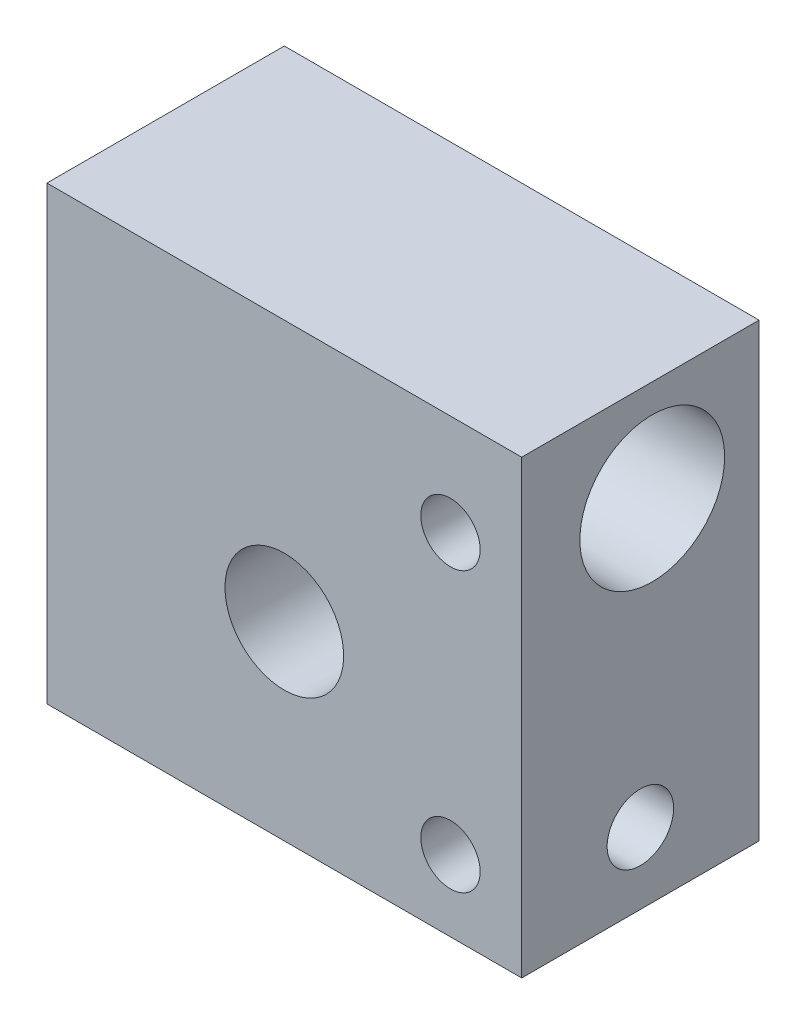
ISO-10303-21;
HEADER;
FILE_DESCRIPTION(('STEP AP214'),'2;1');
FILE_NAME('part.step','',(''),(''),'','','');
FILE_SCHEMA(('AUTOMOTIVE_DESIGN { 1 0 10303 214 1 1 1 1 }'));
ENDSEC;
DATA;
#1=APPLICATION_CONTEXT('core data for automotive mechanical design processes');
#2=APPLICATION_PROTOCOL_DEFINITION('international standard','automotive_design',2000,#1);
#3=PRODUCT_CONTEXT('',#1,'mechanical');
#4=PRODUCT('Part','Part','',(#3));
#5=PRODUCT_RELATED_PRODUCT_CATEGORY('part','',(#4));
#6=PRODUCT_DEFINITION_FORMATION('','',#4);
#7=PRODUCT_DEFINITION_CONTEXT('part definition',#1,'design');
#8=PRODUCT_DEFINITION('design','',#6,#7);
#9=PRODUCT_DEFINITION_SHAPE('','',#8);
#10=(LENGTH_UNIT() NAMED_UNIT(*) SI_UNIT(.MILLI.,.METRE.));
#11=(NAMED_UNIT(*) PLANE_ANGLE_UNIT() SI_UNIT($,.RADIAN.));
#12=(NAMED_UNIT(*) SI_UNIT($,.STERADIAN.) SOLID_ANGLE_UNIT());
#13=UNCERTAINTY_MEASURE_WITH_UNIT(LENGTH_MEASURE(1.E-05),#10,'distance_accuracy_value','');
#14=(GEOMETRIC_REPRESENTATION_CONTEXT(3) GLOBAL_UNCERTAINTY_ASSIGNED_CONTEXT((#13)) GLOBAL_UNIT_ASSIGNED_CONTEXT((#10,
#11,#12)) REPRESENTATION_CONTEXT('',''));
#15=CARTESIAN_POINT('',(0.,0.,0.));
#16=DIRECTION('',(0.,0.,1.));
#17=DIRECTION('',(1.,0.,0.));
#18=AXIS2_PLACEMENT_3D('',#15,#16,#17);
#19=CARTESIAN_POINT('',(10.,-9.5,10.));
#20=DIRECTION('',(-1.,0.,0.));
#21=DIRECTION('',(0.,0.,1.));
#22=AXIS2_PLACEMENT_3D('',#19,#20,#21);
#23=PLANE('',#22);
#24=CARTESIAN_POINT('',(10.,-6.5,5.));
#25=DIRECTION('',(1.,0.,0.));
#26=DIRECTION('',(0.,0.,-1.));
#27=AXIS2_PLACEMENT_3D('',#24,#25,#26);
#28=CIRCLE('',#27,1.39999999999999);
#29=CARTESIAN_POINT('',(10.,-6.5,3.60000000000001));
#30=VERTEX_POINT('',#29);
#31=EDGE_CURVE('E98',#30,#30,#28,.T.);
#32=ORIENTED_EDGE('',*,*,#31,.F.);
#33=EDGE_LOOP('',(#32));
#34=FACE_BOUND('',#33,.T.);
#35=CARTESIAN_POINT('',(10.,5.25,4.5));
#36=DIRECTION('',(1.,0.,0.));
#37=DIRECTION('',(0.,0.,-1.));
#38=AXIS2_PLACEMENT_3D('',#35,#36,#37);
#39=CIRCLE('',#38,3.05);
#40=CARTESIAN_POINT('',(10.,5.25,1.45));
#41=VERTEX_POINT('',#40);
#42=EDGE_CURVE('E97',#41,#41,#39,.T.);
#43=ORIENTED_EDGE('',*,*,#42,.F.);
#44=EDGE_LOOP('',(#43));
#45=FACE_BOUND('',#44,.T.);
#46=DIRECTION('',(0.,1.,0.));
#47=VECTOR('',#46,1.);
#48=CARTESIAN_POINT('',(10.,-9.5,0.));
#49=LINE('',#48,#47);
#50=CARTESIAN_POINT('',(10.,-9.5,0.));
#51=VERTEX_POINT('',#50);
#52=CARTESIAN_POINT('',(10.,9.5,0.));
#53=VERTEX_POINT('',#52);
#54=EDGE_CURVE('E114',#51,#53,#49,.T.);
#55=ORIENTED_EDGE('',*,*,#54,.T.);
#56=DIRECTION('',(0.,0.,-1.));
#57=VECTOR('',#56,1.);
#58=CARTESIAN_POINT('',(10.,9.5,10.));
#59=LINE('',#58,#57);
#60=CARTESIAN_POINT('',(10.,9.5,10.));
#61=VERTEX_POINT('',#60);
#62=EDGE_CURVE('E11',#61,#53,#59,.T.);
#63=ORIENTED_EDGE('',*,*,#62,.F.);
#64=DIRECTION('',(0.,1.,0.));
#65=VECTOR('',#64,1.);
#66=CARTESIAN_POINT('',(10.,-9.5,10.));
#67=LINE('',#66,#65);
#68=CARTESIAN_POINT('',(10.,-9.5,10.));
#69=VERTEX_POINT('',#68);
#70=EDGE_CURVE('E117',#69,#61,#67,.T.);
#71=ORIENTED_EDGE('',*,*,#70,.F.);
#72=DIRECTION('',(0.,0.,-1.));
#73=VECTOR('',#72,1.);
#74=CARTESIAN_POINT('',(10.,-9.5,10.));
#75=LINE('',#74,#73);
#76=EDGE_CURVE('E123',#69,#51,#75,.T.);
#77=ORIENTED_EDGE('',*,*,#76,.T.);
#78=EDGE_LOOP('',(#55,#63,#71,#77));
#79=FACE_BOUND('',#78,.T.);
#80=ADVANCED_FACE('F36',(#34,#45,#79),#23,.F.);
#81=CARTESIAN_POINT('',(-10.,9.5,10.));
#82=DIRECTION('',(0.,-1.,0.));
#83=DIRECTION('',(0.,0.,-1.));
#84=AXIS2_PLACEMENT_3D('',#81,#82,#83);
#85=PLANE('',#84);
#86=DIRECTION('',(-1.,0.,0.));
#87=VECTOR('',#86,1.);
#88=CARTESIAN_POINT('',(-10.,9.5,0.));
#89=LINE('',#88,#87);
#90=CARTESIAN_POINT('',(-10.,9.5,0.));
#91=VERTEX_POINT('',#90);
#92=EDGE_CURVE('E126',#53,#91,#89,.T.);
#93=ORIENTED_EDGE('',*,*,#92,.T.);
#94=DIRECTION('',(0.,0.,-1.));
#95=VECTOR('',#94,1.);
#96=CARTESIAN_POINT('',(-10.,9.5,10.));
#97=LINE('',#96,#95);
#98=CARTESIAN_POINT('',(-10.,9.5,10.));
#99=VERTEX_POINT('',#98);
#100=EDGE_CURVE('E44',#99,#91,#97,.T.);
#101=ORIENTED_EDGE('',*,*,#100,.F.);
#102=DIRECTION('',(-1.,0.,0.));
#103=VECTOR('',#102,1.);
#104=CARTESIAN_POINT('',(-10.,9.5,10.));
#105=LINE('',#104,#103);
#106=EDGE_CURVE('E83',#61,#99,#105,.T.);
#107=ORIENTED_EDGE('',*,*,#106,.F.);
#108=ORIENTED_EDGE('',*,*,#62,.T.);
#109=EDGE_LOOP('',(#93,#101,#107,#108));
#110=FACE_BOUND('',#109,.T.);
#111=ADVANCED_FACE('F150',(#110),#85,.F.);
#112=CARTESIAN_POINT('',(-10.,-9.5,10.));
#113=DIRECTION('',(1.,0.,0.));
#114=DIRECTION('',(0.,0.,-1.));
#115=AXIS2_PLACEMENT_3D('',#112,#113,#114);
#116=PLANE('',#115);
#117=CARTESIAN_POINT('',(-10.,5.25,4.5));
#118=DIRECTION('',(1.,0.,0.));
#119=DIRECTION('',(0.,0.,-1.));
#120=AXIS2_PLACEMENT_3D('',#117,#118,#119);
#121=CIRCLE('',#120,3.05);
#122=CARTESIAN_POINT('',(-10.,5.25,1.45));
#123=VERTEX_POINT('',#122);
#124=EDGE_CURVE('E101',#123,#123,#121,.T.);
#125=ORIENTED_EDGE('',*,*,#124,.T.);
#126=EDGE_LOOP('',(#125));
#127=FACE_BOUND('',#126,.T.);
#128=DIRECTION('',(0.,-1.,0.));
#129=VECTOR('',#128,1.);
#130=CARTESIAN_POINT('',(-10.,-9.5,0.));
#131=LINE('',#130,#129);
#132=CARTESIAN_POINT('',(-10.,-9.5,0.));
#133=VERTEX_POINT('',#132);
#134=EDGE_CURVE('E70',#91,#133,#131,.T.);
#135=ORIENTED_EDGE('',*,*,#134,.T.);
#136=DIRECTION('',(0.,0.,-1.));
#137=VECTOR('',#136,1.);
#138=CARTESIAN_POINT('',(-10.,-9.5,10.));
#139=LINE('',#138,#137);
#140=CARTESIAN_POINT('',(-10.,-9.5,10.));
#141=VERTEX_POINT('',#140);
#142=EDGE_CURVE('E131',#141,#133,#139,.T.);
#143=ORIENTED_EDGE('',*,*,#142,.F.);
#144=DIRECTION('',(0.,-1.,0.));
#145=VECTOR('',#144,1.);
#146=CARTESIAN_POINT('',(-10.,-9.5,10.));
#147=LINE('',#146,#145);
#148=EDGE_CURVE('E120',#99,#141,#147,.T.);
#149=ORIENTED_EDGE('',*,*,#148,.F.);
#150=ORIENTED_EDGE('',*,*,#100,.T.);
#151=EDGE_LOOP('',(#135,#143,#149,#150));
#152=FACE_BOUND('',#151,.T.);
#153=ADVANCED_FACE('F133',(#127,#152),#116,.F.);
#154=CARTESIAN_POINT('',(-10.,-9.5,10.));
#155=DIRECTION('',(0.,1.,0.));
#156=DIRECTION('',(0.,0.,1.));
#157=AXIS2_PLACEMENT_3D('',#154,#155,#156);
#158=PLANE('',#157);
#159=DIRECTION('',(1.,0.,0.));
#160=VECTOR('',#159,1.);
#161=CARTESIAN_POINT('',(-10.,-9.5,0.));
#162=LINE('',#161,#160);
#163=EDGE_CURVE('E76',#133,#51,#162,.T.);
#164=ORIENTED_EDGE('',*,*,#163,.T.);
#165=ORIENTED_EDGE('',*,*,#76,.F.);
#166=DIRECTION('',(1.,0.,0.));
#167=VECTOR('',#166,1.);
#168=CARTESIAN_POINT('',(-10.,-9.5,10.));
#169=LINE('',#168,#167);
#170=EDGE_CURVE('E52',#141,#69,#169,.T.);
#171=ORIENTED_EDGE('',*,*,#170,.F.);
#172=ORIENTED_EDGE('',*,*,#142,.T.);
#173=EDGE_LOOP('',(#164,#165,#171,#172));
#174=FACE_BOUND('',#173,.T.);
#175=ADVANCED_FACE('F140',(#174),#158,.F.);
#176=CARTESIAN_POINT('',(0.,0.,10.));
#177=DIRECTION('',(0.,0.,-1.));
#178=DIRECTION('',(-1.,0.,0.));
#179=AXIS2_PLACEMENT_3D('',#176,#177,#178);
#180=PLANE('',#179);
#181=CARTESIAN_POINT('',(7.,5.25,10.));
#182=DIRECTION('',(0.,0.,1.));
#183=DIRECTION('',(1.,0.,0.));
#184=AXIS2_PLACEMENT_3D('',#181,#182,#183);
#185=CIRCLE('',#184,1.24999999999999);
#186=CARTESIAN_POINT('',(8.24999999999998,5.25,10.));
#187=VERTEX_POINT('',#186);
#188=EDGE_CURVE('E278',#187,#187,#185,.T.);
#189=ORIENTED_EDGE('',*,*,#188,.F.);
#190=EDGE_LOOP('',(#189));
#191=FACE_BOUND('',#190,.T.);
#192=CARTESIAN_POINT('',(7.,-6.5,10.));
#193=DIRECTION('',(0.,0.,1.));
#194=DIRECTION('',(1.,0.,0.));
#195=AXIS2_PLACEMENT_3D('',#192,#193,#194);
#196=CIRCLE('',#195,1.24999999999999);
#197=CARTESIAN_POINT('',(8.24999999999998,-6.5,10.));
#198=VERTEX_POINT('',#197);
#199=EDGE_CURVE('E271',#198,#198,#196,.T.);
#200=ORIENTED_EDGE('',*,*,#199,.F.);
#201=EDGE_LOOP('',(#200));
#202=FACE_BOUND('',#201,.T.);
#203=CARTESIAN_POINT('',(0.,-1.5,10.));
#204=DIRECTION('',(0.,0.,-1.));
#205=DIRECTION('',(-1.,0.,0.));
#206=AXIS2_PLACEMENT_3D('',#203,#204,#205);
#207=CIRCLE('',#206,2.5);
#208=CARTESIAN_POINT('',(-2.5,-1.5,10.));
#209=VERTEX_POINT('',#208);
#210=EDGE_CURVE('E111',#209,#209,#207,.T.);
#211=ORIENTED_EDGE('',*,*,#210,.T.);
#212=EDGE_LOOP('',(#211));
#213=FACE_BOUND('',#212,.T.);
#214=ORIENTED_EDGE('',*,*,#70,.T.);
#215=ORIENTED_EDGE('',*,*,#106,.T.);
#216=ORIENTED_EDGE('',*,*,#148,.T.);
#217=ORIENTED_EDGE('',*,*,#170,.T.);
#218=EDGE_LOOP('',(#214,#215,#216,#217));
#219=FACE_BOUND('',#218,.T.);
#220=ADVANCED_FACE('F142',(#191,#202,#213,#219),#180,.F.);
#221=CARTESIAN_POINT('',(0.,0.,0.));
#222=DIRECTION('',(0.,0.,-1.));
#223=DIRECTION('',(-1.,0.,0.));
#224=AXIS2_PLACEMENT_3D('',#221,#222,#223);
#225=PLANE('',#224);
#226=CARTESIAN_POINT('',(0.,-1.5,0.));
#227=DIRECTION('',(0.,0.,-1.));
#228=DIRECTION('',(-1.,0.,0.));
#229=AXIS2_PLACEMENT_3D('',#226,#227,#228);
#230=CIRCLE('',#229,2.5);
#231=CARTESIAN_POINT('',(-2.5,-1.5,0.));
#232=VERTEX_POINT('',#231);
#233=EDGE_CURVE('E109',#232,#232,#230,.T.);
#234=ORIENTED_EDGE('',*,*,#233,.F.);
#235=EDGE_LOOP('',(#234));
#236=FACE_BOUND('',#235,.T.);
#237=ORIENTED_EDGE('',*,*,#54,.F.);
#238=ORIENTED_EDGE('',*,*,#163,.F.);
#239=ORIENTED_EDGE('',*,*,#134,.F.);
#240=ORIENTED_EDGE('',*,*,#92,.F.);
#241=EDGE_LOOP('',(#237,#238,#239,#240));
#242=FACE_BOUND('',#241,.T.);
#243=ADVANCED_FACE('F136',(#236,#242),#225,.T.);
#244=CARTESIAN_POINT('',(0.,-1.5,10.));
#245=DIRECTION('',(0.,0.,-1.));
#246=DIRECTION('',(-1.,0.,0.));
#247=AXIS2_PLACEMENT_3D('',#244,#245,#246);
#248=CYLINDRICAL_SURFACE('',#247,2.5);
#249=ORIENTED_EDGE('',*,*,#210,.F.);
#250=EDGE_LOOP('',(#249));
#251=FACE_BOUND('',#250,.T.);
#252=ORIENTED_EDGE('',*,*,#233,.T.);
#253=EDGE_LOOP('',(#252));
#254=FACE_BOUND('',#253,.T.);
#255=ADVANCED_FACE('F164',(#251,#254),#248,.F.);
#256=CARTESIAN_POINT('',(-10.,5.25,4.5));
#257=DIRECTION('',(1.,0.,0.));
#258=DIRECTION('',(0.,0.,-1.));
#259=AXIS2_PLACEMENT_3D('',#256,#257,#258);
#260=CYLINDRICAL_SURFACE('',#259,3.05);
#261=CARTESIAN_POINT('',(8.24999999999999,5.25,7.55));
#262=CARTESIAN_POINT('',(8.24999317358083,5.31705105449435,7.5499949013604));
#263=CARTESIAN_POINT('',(8.24457289041589,5.38421220939516,7.54776316601173));
#264=CARTESIAN_POINT('',(8.2230821427269,5.51663531512961,7.53905220749816));
#265=CARTESIAN_POINT('',(8.2069833965083,5.58189174087961,7.53256170556949));
#266=CARTESIAN_POINT('',(8.16482596800735,5.70837429284752,7.51603149034563));
#267=CARTESIAN_POINT('',(8.13880056530878,5.7696130929358,7.50600364451594));
#268=CARTESIAN_POINT('',(8.07766372514542,5.88679775394014,7.48337979201622));
#269=CARTESIAN_POINT('',(8.04255520538643,5.94274530666015,7.47078461030852));
#270=CARTESIAN_POINT('',(7.96243359833867,6.05058268229026,7.44360272183732));
#271=CARTESIAN_POINT('',(7.91704813784625,6.10217961883631,7.42895218720805));
#272=CARTESIAN_POINT('',(7.81844769395315,6.19727980579278,7.3995935820288));
#273=CARTESIAN_POINT('',(7.76522873562099,6.24077892161812,7.38488548598071));
#274=CARTESIAN_POINT('',(7.6494220879687,6.32047635819198,7.35630174305004));
#275=CARTESIAN_POINT('',(7.58651058665788,6.35623272255294,7.34249824263372));
#276=CARTESIAN_POINT('',(7.45491722684178,6.41652509902148,7.31829427065235));
#277=CARTESIAN_POINT('',(7.38623826542879,6.4410667050528,7.30789210323986));
#278=CARTESIAN_POINT('',(7.24842884283272,6.477033698322,7.29235707938262));
#279=CARTESIAN_POINT('',(7.17947149284317,6.48902161527503,7.28699943260884));
#280=CARTESIAN_POINT('',(7.04033187566907,6.50129693566521,7.28151145539133));
#281=CARTESIAN_POINT('',(6.97015027248521,6.50159049579919,7.28137837438494));
#282=CARTESIAN_POINT('',(6.83607409840986,6.49089353762404,7.28616368996563));
#283=CARTESIAN_POINT('',(6.7720974072659,6.48073314256808,7.2907104791605));
#284=CARTESIAN_POINT('',(6.64685271703792,6.45080567936669,7.30371701324258));
#285=CARTESIAN_POINT('',(6.58558521945646,6.43103684064336,7.31217747930137));
#286=CARTESIAN_POINT('',(6.46597856734735,6.38207159424284,7.33224715740189));
#287=CARTESIAN_POINT('',(6.40772757534972,6.35268647565431,7.34391858333761));
#288=CARTESIAN_POINT('',(6.29676189319712,6.28545581744839,7.3690795378448));
#289=CARTESIAN_POINT('',(6.24404935655717,6.2476070046597,7.38256976900067));
#290=CARTESIAN_POINT('',(6.14113506271575,6.16089979031177,7.41118669367845));
#291=CARTESIAN_POINT('',(6.09148817119212,6.11139546177047,7.42635714795841));
#292=CARTESIAN_POINT('',(6.00101833818233,6.00460843164101,7.45569448523891));
#293=CARTESIAN_POINT('',(5.96019733238115,5.94732402821036,7.46986114763168));
#294=CARTESIAN_POINT('',(5.88776019476994,5.82496342854657,7.49598214323011));
#295=CARTESIAN_POINT('',(5.85636271935723,5.75974527572702,7.50788187819974));
#296=CARTESIAN_POINT('',(5.80517803112997,5.62434088842293,7.52771185130719));
#297=CARTESIAN_POINT('',(5.78538461664024,5.55415733016856,7.53564420943661));
#298=CARTESIAN_POINT('',(5.75911499785756,5.4154572004104,7.54625363825052));
#299=CARTESIAN_POINT('',(5.75189372784432,5.34710415103708,7.54922426910946));
#300=CARTESIAN_POINT('',(5.74876092149755,5.21010441371817,7.5505074612745));
#301=CARTESIAN_POINT('',(5.75284627086616,5.14145781182912,7.54882130524732));
#302=CARTESIAN_POINT('',(5.77167121733155,5.00926209998629,7.54117156509262));
#303=CARTESIAN_POINT('',(5.78589367478943,4.94562598291882,7.53541570476584));
#304=CARTESIAN_POINT('',(5.82387605471634,4.82170816248345,7.52042451329165));
#305=CARTESIAN_POINT('',(5.84763719121059,4.76142688721188,7.51118873925112));
#306=CARTESIAN_POINT('',(5.90479928404273,4.64383011012163,7.48977295322551));
#307=CARTESIAN_POINT('',(5.93847544195123,4.58666382302296,7.47751077732146));
#308=CARTESIAN_POINT('',(6.01420811639302,4.47859041874229,7.45135965585715));
#309=CARTESIAN_POINT('',(6.05626807827196,4.42768588879936,7.43747004246777));
#310=CARTESIAN_POINT('',(6.15098440399942,4.32987991098666,7.4083776173988));
#311=CARTESIAN_POINT('',(6.20417275944046,4.28349954211682,7.39315046142814));
#312=CARTESIAN_POINT('',(6.31783195761042,4.20018452435906,7.36397295744693));
#313=CARTESIAN_POINT('',(6.37830425548019,4.16325176747518,7.35002286554325));
#314=CARTESIAN_POINT('',(6.50591935720062,4.09955272757804,7.32491824303052));
#315=CARTESIAN_POINT('',(6.5731350035576,4.07291696039833,7.3138001745101));
#316=CARTESIAN_POINT('',(6.71169404128461,4.03156002386075,7.29614362783962));
#317=CARTESIAN_POINT('',(6.78303413036749,4.01682946022231,7.28960153937764));
#318=CARTESIAN_POINT('',(6.92205571719578,4.00061997017984,7.28237686582237));
#319=CARTESIAN_POINT('',(6.98961071540186,3.99823064874134,7.28129189039514));
#320=CARTESIAN_POINT('',(7.12411541510115,4.00435741732201,7.28404131006805));
#321=CARTESIAN_POINT('',(7.1910652011546,4.01287195937366,7.2878750068888));
#322=CARTESIAN_POINT('',(7.31945958453319,4.03980857539514,7.29966724973413));
#323=CARTESIAN_POINT('',(7.38101694579431,4.05778270632242,7.30743875303861));
#324=CARTESIAN_POINT('',(7.50026093044537,4.10269826055876,7.32609039777681));
#325=CARTESIAN_POINT('',(7.5579464682445,4.12964218632339,7.33697140660187));
#326=CARTESIAN_POINT('',(7.67152052867124,4.19356546820026,7.36141244323642));
#327=CARTESIAN_POINT('',(7.72710231558399,4.23104304994741,7.37509264152988));
#328=CARTESIAN_POINT('',(7.83147333634056,4.31425954659736,7.40324259102355));
#329=CARTESIAN_POINT('',(7.88026033074679,4.3600011738197,7.41771260035406));
#330=CARTESIAN_POINT('',(7.97314082024465,4.46222488066987,7.44701985281455));
#331=CARTESIAN_POINT('',(8.01667265144533,4.51923240654681,7.461812751821));
#332=CARTESIAN_POINT('',(8.09357367951555,4.64029737005191,7.48908126299053));
#333=CARTESIAN_POINT('',(8.1269382146159,4.70435802331352,7.50155581115557));
#334=CARTESIAN_POINT('',(8.18180811191665,4.83663629870453,7.52258806460315));
#335=CARTESIAN_POINT('',(8.20351052450805,4.90476171520484,7.53121040731175));
#336=CARTESIAN_POINT('',(8.23495872650017,5.04399616753341,7.54383134859934));
#337=CARTESIAN_POINT('',(8.24474216568277,5.11509507070934,7.54784450441534));
#338=CARTESIAN_POINT('',(8.24946289651355,5.20760124338892,7.54978053015449));
#339=CARTESIAN_POINT('',(8.25000215885384,5.22879511590617,7.55000161244387));
#340=CARTESIAN_POINT('',(8.24999999999999,5.25,7.55));
#341=B_SPLINE_CURVE_WITH_KNOTS('',3,(#261,#262,#263,#264,#265,#266,#267,#268,#269,#270,#271,
#272,#273,#274,#275,#276,#277,#278,#279,#280,#281,#282,#283,#284,#285,#286,#287,#288,#289,#290,
#291,#292,#293,#294,#295,#296,#297,#298,#299,#300,#301,#302,#303,#304,#305,#306,#307,#308,#309,
#310,#311,#312,#313,#314,#315,#316,#317,#318,#319,#320,#321,#322,#323,#324,#325,#326,#327,#328,
#329,#330,#331,#332,#333,#334,#335,#336,#337,#338,#339,#340),.UNSPECIFIED.,.T.,.F.,(4,2,2,2,2,2,
2,2,2,2,2,2,2,2,2,2,2,2,2,2,2,2,2,2,2,2,2,2,2,2,2,2,2,2,2,2,2,2,2,4),(0.,0.201094311180327,
0.402723354574274,0.603682285542808,0.804576743863708,1.01444492091329,1.22441996030868,
1.44431409976959,1.66409843594335,1.87354721803841,2.08288573073388,2.27679448285735,
2.47073898070664,2.66874390795882,2.86682554265503,3.08105274490332,3.29532688370776,
3.51424468844055,3.73304538781654,3.93837132545347,4.14364071369572,4.33912550528581,
4.53463518488672,4.73618655641969,4.9378209274047,5.15341391236424,5.36905003881042,
5.58733616568886,5.80544987646513,6.00721727204662,6.20895602688514,6.40190297186301,
6.59490379169176,6.79928960640031,7.00374262427848,7.22240178249367,7.44116104698124,
7.65609749208749,7.87035321839582,7.93394925864702),.UNSPECIFIED.);
#342=CARTESIAN_POINT('',(8.24999999999999,5.25,7.55));
#343=VERTEX_POINT('',#342);
#344=EDGE_CURVE('E274',#343,#343,#341,.T.);
#345=ORIENTED_EDGE('',*,*,#344,.T.);
#346=EDGE_LOOP('',(#345));
#347=FACE_BOUND('',#346,.T.);
#348=ORIENTED_EDGE('',*,*,#124,.F.);
#349=EDGE_LOOP('',(#348));
#350=FACE_BOUND('',#349,.T.);
#351=ORIENTED_EDGE('',*,*,#42,.T.);
#352=EDGE_LOOP('',(#351));
#353=FACE_BOUND('',#352,.T.);
#354=ADVANCED_FACE('F91',(#347,#350,#353),#260,.F.);
#355=CARTESIAN_POINT('',(-4.,-6.5,5.));
#356=DIRECTION('',(1.,0.,0.));
#357=DIRECTION('',(0.,0.,-1.));
#358=AXIS2_PLACEMENT_3D('',#355,#356,#357);
#359=CONICAL_SURFACE('',#358,1.4,1.02974425867665);
#360=CARTESIAN_POINT('',(-4.84120486663859,-6.5,5.));
#361=VERTEX_POINT('',#360);
#362=VERTEX_LOOP('',#361);
#363=FACE_BOUND('',#362,.T.);
#364=CARTESIAN_POINT('',(-4.,-6.5,5.));
#365=DIRECTION('',(1.,0.,0.));
#366=DIRECTION('',(0.,0.,-1.));
#367=AXIS2_PLACEMENT_3D('',#364,#365,#366);
#368=CIRCLE('',#367,1.4);
#369=CARTESIAN_POINT('',(-4.,-6.5,3.6));
#370=VERTEX_POINT('',#369);
#371=EDGE_CURVE('E95',#370,#370,#368,.T.);
#372=ORIENTED_EDGE('',*,*,#371,.T.);
#373=EDGE_LOOP('',(#372));
#374=FACE_BOUND('',#373,.T.);
#375=ADVANCED_FACE('F87',(#363,#374),#359,.F.);
#376=CARTESIAN_POINT('',(10.,-6.5,5.));
#377=DIRECTION('',(1.,0.,0.));
#378=DIRECTION('',(0.,0.,-1.));
#379=AXIS2_PLACEMENT_3D('',#376,#377,#378);
#380=CYLINDRICAL_SURFACE('',#379,1.39999999999999);
#381=CARTESIAN_POINT('',(8.24999999999999,-6.5,6.39999999999999));
#382=CARTESIAN_POINT('',(8.2499949868592,-6.44194168676508,6.39999505708481));
#383=CARTESIAN_POINT('',(8.24592080502687,-6.38382846990261,6.39635413738623));
#384=CARTESIAN_POINT('',(8.22993189050256,-6.26953992529191,6.3821070504739));
#385=CARTESIAN_POINT('',(8.21800521318853,-6.21336768723299,6.37149027216184));
#386=CARTESIAN_POINT('',(8.18725795190837,-6.10493647132189,6.34425840789472));
#387=CARTESIAN_POINT('',(8.16848287616017,-6.05265434303445,6.32768292831383));
#388=CARTESIAN_POINT('',(8.12506838582732,-5.95254788273914,6.28963963345016));
#389=CARTESIAN_POINT('',(8.10042747239283,-5.90472469444162,6.26817056780878));
#390=CARTESIAN_POINT('',(8.03557196222588,-5.79606762050386,6.21224494072257));
#391=CARTESIAN_POINT('',(7.99304652840318,-5.73753163996485,6.17600411593791));
#392=CARTESIAN_POINT('',(7.9004866632574,-5.63012888560068,6.09896136486939));
#393=CARTESIAN_POINT('',(7.85043337059612,-5.58128713509936,6.05814804948434));
#394=CARTESIAN_POINT('',(7.74272730803302,-5.49209874990849,5.97363909440282));
#395=CARTESIAN_POINT('',(7.68492632268766,-5.4519731489019,5.92989876939865));
#396=CARTESIAN_POINT('',(7.5932929179699,-5.39921018500105,5.86546950449096));
#397=CARTESIAN_POINT('',(7.56194400448323,-5.38286666090873,5.84420068301713));
#398=CARTESIAN_POINT('',(7.49742349064476,-5.35268185763238,5.80269321130381));
#399=CARTESIAN_POINT('',(7.46425314824848,-5.33883887911766,5.78245386821813));
#400=CARTESIAN_POINT('',(7.39565708946749,-5.31370410692059,5.74379826592161));
#401=CARTESIAN_POINT('',(7.36022015607037,-5.3024265007576,5.72539244718265));
#402=CARTESIAN_POINT('',(7.28699686952963,-5.28280433217212,5.69196067439365));
#403=CARTESIAN_POINT('',(7.24921364582112,-5.27445595765662,5.67693033674654));
#404=CARTESIAN_POINT('',(7.17777888573999,-5.26226942201709,5.65434069011702));
#405=CARTESIAN_POINT('',(7.14448846768489,-5.25791141736613,5.64595366125018));
#406=CARTESIAN_POINT('',(7.07681399900873,-5.25190279743323,5.63427082722178));
#407=CARTESIAN_POINT('',(7.04243272490459,-5.2502457952295,5.63096301258151));
#408=CARTESIAN_POINT('',(6.97344996739367,-5.24980465515516,5.63008902910067));
#409=CARTESIAN_POINT('',(6.93884813600081,-5.25103079169914,5.63254339443863));
#410=CARTESIAN_POINT('',(6.87062088239697,-5.25624018783835,5.64272207570755));
#411=CARTESIAN_POINT('',(6.83699774304588,-5.26022942734128,5.65045782108092));
#412=CARTESIAN_POINT('',(6.75544518207015,-5.27316153709023,5.67463233000181));
#413=CARTESIAN_POINT('',(6.70848699902955,-5.2835685957092,5.69347246790297));
#414=CARTESIAN_POINT('',(6.61807364479246,-5.30884349350265,5.7360450974219));
#415=CARTESIAN_POINT('',(6.57463420866663,-5.32373010199526,5.75979804013713));
#416=CARTESIAN_POINT('',(6.49537128940632,-5.35568043255668,5.80700580784672));
#417=CARTESIAN_POINT('',(6.45923222488731,-5.37233458599597,5.83021505543801));
#418=CARTESIAN_POINT('',(6.38912352893967,-5.40872072453205,5.87749817561828));
#419=CARTESIAN_POINT('',(6.35515544195418,-5.42845486713809,5.90157264511978));
#420=CARTESIAN_POINT('',(6.25633804756407,-5.49222000601739,5.973906504989));
#421=CARTESIAN_POINT('',(6.19447424355025,-5.54085517071726,6.02234188402847));
#422=CARTESIAN_POINT('',(6.08958230379854,-5.64097609885848,6.10707408662594));
#423=CARTESIAN_POINT('',(6.04515383574102,-5.6904642521704,6.14400956231909));
#424=CARTESIAN_POINT('',(5.96351300032746,-5.79804896410573,6.21298169510052));
#425=CARTESIAN_POINT('',(5.92628639244701,-5.85612812543602,6.24502799265862));
#426=CARTESIAN_POINT('',(5.86800648107553,-5.96697435759722,6.29566673283867));
#427=CARTESIAN_POINT('',(5.8451965489781,-6.01816802049117,6.31566982787633));
#428=CARTESIAN_POINT('',(5.80626889214564,-6.12486906658095,6.34996603904797));
#429=CARTESIAN_POINT('',(5.79014730627661,-6.18037393891143,6.3642624494289));
#430=CARTESIAN_POINT('',(5.76556496564551,-6.29478550807749,6.38610888836235));
#431=CARTESIAN_POINT('',(5.75715688909207,-6.35371271670025,6.39361252217823));
#432=CARTESIAN_POINT('',(5.74888153606879,-6.47263340657098,6.40099734992621));
#433=CARTESIAN_POINT('',(5.74901012217232,-6.53262635719524,6.40088223640306));
#434=CARTESIAN_POINT('',(5.75729726392508,-6.64496179299008,6.39348757613018));
#435=CARTESIAN_POINT('',(5.7645794583678,-6.69742569428969,6.38698993375036));
#436=CARTESIAN_POINT('',(5.78541955691335,-6.80006317527944,6.36846008851627));
#437=CARTESIAN_POINT('',(5.79897855235843,-6.85023635501637,6.35642692320744));
#438=CARTESIAN_POINT('',(5.83224726913679,-6.9490838192012,6.32705793831451));
#439=CARTESIAN_POINT('',(5.85216809247043,-6.99763183340567,6.30954060471521));
#440=CARTESIAN_POINT('',(5.89706297685908,-7.09050383114845,6.27037427363401));
#441=CARTESIAN_POINT('',(5.92203894689979,-7.13482620962182,6.24872371548974));
#442=CARTESIAN_POINT('',(5.98997410907676,-7.24029341103859,6.19046351224896));
#443=CARTESIAN_POINT('',(6.0356348635312,-7.29858997340156,6.15183094190059));
#444=CARTESIAN_POINT('',(6.1346322683624,-7.40495861483331,6.07031269788652));
#445=CARTESIAN_POINT('',(6.18799452152662,-7.45299520976842,6.02741299261144));
#446=CARTESIAN_POINT('',(6.30271260974546,-7.54000210644887,5.93930057762702));
#447=CARTESIAN_POINT('',(6.36422489937964,-7.57873677718025,5.89405731271187));
#448=CARTESIAN_POINT('',(6.46193789704502,-7.62885678204904,5.82852014969733));
#449=CARTESIAN_POINT('',(6.49538063785895,-7.64422187468972,5.80708239997717));
#450=CARTESIAN_POINT('',(6.56434279557158,-7.67221503910712,5.76585117598206));
#451=CARTESIAN_POINT('',(6.59985983733029,-7.68484616625741,5.74605588158578));
#452=CARTESIAN_POINT('',(6.66993474011423,-7.70613948004129,5.71106159363072));
#453=CARTESIAN_POINT('',(6.70428413624694,-7.71505873547901,5.69560796896608));
#454=CARTESIAN_POINT('',(6.7750526114321,-7.73012219902392,5.66860982661791));
#455=CARTESIAN_POINT('',(6.81146672688317,-7.73627276908919,5.65705636249251));
#456=CARTESIAN_POINT('',(6.8806771234141,-7.7447058682317,5.64092136709326));
#457=CARTESIAN_POINT('',(6.91323424333292,-7.74741938794272,5.63557278941437));
#458=CARTESIAN_POINT('',(6.9788871964835,-7.75025197225837,5.62998549533313));
#459=CARTESIAN_POINT('',(7.01198237806755,-7.75037397075177,5.62974100054961));
#460=CARTESIAN_POINT('',(7.07762813988973,-7.74801950319066,5.63439113540341));
#461=CARTESIAN_POINT('',(7.11017965650368,-7.74554810522642,5.63927574161564));
#462=CARTESIAN_POINT('',(7.17408333676835,-7.73823823113208,5.65332065002824));
#463=CARTESIAN_POINT('',(7.20543307300662,-7.73339521103319,5.6624891585257));
#464=CARTESIAN_POINT('',(7.28945961548702,-7.71724311372087,5.69192802477486));
#465=CARTESIAN_POINT('',(7.34058350006695,-7.70380606390251,5.71537628828614));
#466=CARTESIAN_POINT('',(7.43870290015509,-7.67163343838705,5.76694866137185));
#467=CARTESIAN_POINT('',(7.48567840080503,-7.65287383842538,5.7950937279711));
#468=CARTESIAN_POINT('',(7.56811634569578,-7.61419410722582,5.84820818645355));
#469=CARTESIAN_POINT('',(7.60415141974228,-7.59505708860184,5.87286661510829));
#470=CARTESIAN_POINT('',(7.67399437716107,-7.55351064982516,5.9225878352233));
#471=CARTESIAN_POINT('',(7.70780093121611,-7.53109930170705,5.94765085712552));
#472=CARTESIAN_POINT('',(7.80586114325294,-7.45899356175542,6.02229970468874));
#473=CARTESIAN_POINT('',(7.86694508236083,-7.40433810482137,6.07147596925429));
#474=CARTESIAN_POINT('',(7.96489458812916,-7.29707599558306,6.15238448121645));
#475=CARTESIAN_POINT('',(8.00398092944618,-7.24743619023366,6.18538618084687));
#476=CARTESIAN_POINT('',(8.0752650549896,-7.14063303743435,6.24633417161369));
#477=CARTESIAN_POINT('',(8.10747267864202,-7.0834806278967,6.27428767480381));
#478=CARTESIAN_POINT('',(8.15806012579765,-6.97364539258132,6.31851607191242));
#479=CARTESIAN_POINT('',(8.17789926682108,-6.92212330457436,6.33599721353313));
#480=CARTESIAN_POINT('',(8.21082753799314,-6.81542961816186,6.36511658482002));
#481=CARTESIAN_POINT('',(8.22392985942279,-6.76026539235725,6.37676623186912));
#482=CARTESIAN_POINT('',(8.23877753476079,-6.67054630344316,6.38998707819501));
#483=CARTESIAN_POINT('',(8.24297332608233,-6.63669211479529,6.39372919288244));
#484=CARTESIAN_POINT('',(8.24858632464114,-6.5685650584899,6.39873736790695));
#485=CARTESIAN_POINT('',(8.25000296100845,-6.53429210626811,6.40000291952975));
#486=CARTESIAN_POINT('',(8.24999999999999,-6.5,6.39999999999999));
#487=B_SPLINE_CURVE_WITH_KNOTS('',3,(#381,#382,#383,#384,#385,#386,#387,#388,#389,#390,#391,
#392,#393,#394,#395,#396,#397,#398,#399,#400,#401,#402,#403,#404,#405,#406,#407,#408,#409,#410,
#411,#412,#413,#414,#415,#416,#417,#418,#419,#420,#421,#422,#423,#424,#425,#426,#427,#428,#429,
#430,#431,#432,#433,#434,#435,#436,#437,#438,#439,#440,#441,#442,#443,#444,#445,#446,#447,#448,
#449,#450,#451,#452,#453,#454,#455,#456,#457,#458,#459,#460,#461,#462,#463,#464,#465,#466,#467,
#468,#469,#470,#471,#472,#473,#474,#475,#476,#477,#478,#479,#480,#481,#482,#483,#484,#485,#486),
.UNSPECIFIED.,.T.,.F.,(4,2,2,2,2,2,2,2,2,2,2,2,2,2,2,2,2,2,2,2,2,2,2,2,2,2,2,2,2,2,2,2,2,2,2,2,
2,2,2,2,2,2,2,2,2,2,2,2,2,2,2,2,4),(0.,0.174025199171828,0.348315725793754,0.521468569338327,
0.694665704803348,0.936104192030469,1.17815801353366,1.42577476262633,1.54945485830296,
1.67305058413419,1.79731406828389,1.92141523122593,2.02482995082708,2.12799977432864,
2.23153781290793,2.33530063153894,2.48939285191875,2.6441399282268,2.78215128790143,
2.9202597610257,3.19609796183155,3.42353549242881,3.65051859916236,3.82834642526319,
4.00607144931125,4.18500137436829,4.36384457888121,4.52320348888357,4.68259011690153,
4.84793875535594,5.01334995165814,5.2625317020197,5.51256177257709,5.76838009318242,
5.89603749618421,6.02355148907263,6.13942393797543,6.25502875573549,6.3539018857756,
6.45266307451914,6.55123162008651,6.64998976382977,6.82248463888625,6.99577083624625,
7.13860865442708,7.28153091878113,7.56664241411738,7.77976835463441,7.99258736381436,
8.16563456566077,8.33834162307875,8.44110839048082,8.54389626513337),.UNSPECIFIED.);
#488=CARTESIAN_POINT('',(8.24999999999999,-6.5,6.39999999999999));
#489=VERTEX_POINT('',#488);
#490=EDGE_CURVE('E104',#489,#489,#487,.T.);
#491=ORIENTED_EDGE('',*,*,#490,.T.);
#492=EDGE_LOOP('',(#491));
#493=FACE_BOUND('',#492,.T.);
#494=ORIENTED_EDGE('',*,*,#371,.F.);
#495=EDGE_LOOP('',(#494));
#496=FACE_BOUND('',#495,.T.);
#497=ORIENTED_EDGE('',*,*,#31,.T.);
#498=EDGE_LOOP('',(#497));
#499=FACE_BOUND('',#498,.T.);
#500=ADVANCED_FACE('F90',(#493,#496,#499),#380,.F.);
#501=CARTESIAN_POINT('',(7.,-6.5,10.));
#502=DIRECTION('',(0.,0.,1.));
#503=DIRECTION('',(1.,0.,0.));
#504=AXIS2_PLACEMENT_3D('',#501,#502,#503);
#505=CYLINDRICAL_SURFACE('',#504,1.24999999999999);
#506=ORIENTED_EDGE('',*,*,#490,.F.);
#507=EDGE_LOOP('',(#506));
#508=FACE_BOUND('',#507,.T.);
#509=ORIENTED_EDGE('',*,*,#199,.T.);
#510=EDGE_LOOP('',(#509));
#511=FACE_BOUND('',#510,.T.);
#512=ADVANCED_FACE('F193',(#508,#511),#505,.F.);
#513=CARTESIAN_POINT('',(7.,5.25,10.));
#514=DIRECTION('',(0.,0.,1.));
#515=DIRECTION('',(1.,0.,0.));
#516=AXIS2_PLACEMENT_3D('',#513,#514,#515);
#517=CYLINDRICAL_SURFACE('',#516,1.24999999999999);
#518=ORIENTED_EDGE('',*,*,#344,.F.);
#519=EDGE_LOOP('',(#518));
#520=FACE_BOUND('',#519,.T.);
#521=ORIENTED_EDGE('',*,*,#188,.T.);
#522=EDGE_LOOP('',(#521));
#523=FACE_BOUND('',#522,.T.);
#524=ADVANCED_FACE('F198',(#520,#523),#517,.F.);
#525=CLOSED_SHELL('',(#80,#111,#153,#175,#220,#243,#255,#354,#375,#500,#512,#524));
#526=MANIFOLD_SOLID_BREP('B2',#525);
#527=ADVANCED_BREP_SHAPE_REPRESENTATION('',(#18,#526),#14);
#528=SHAPE_DEFINITION_REPRESENTATION(#9,#527);
ENDSEC;
END-ISO-10303-21;
